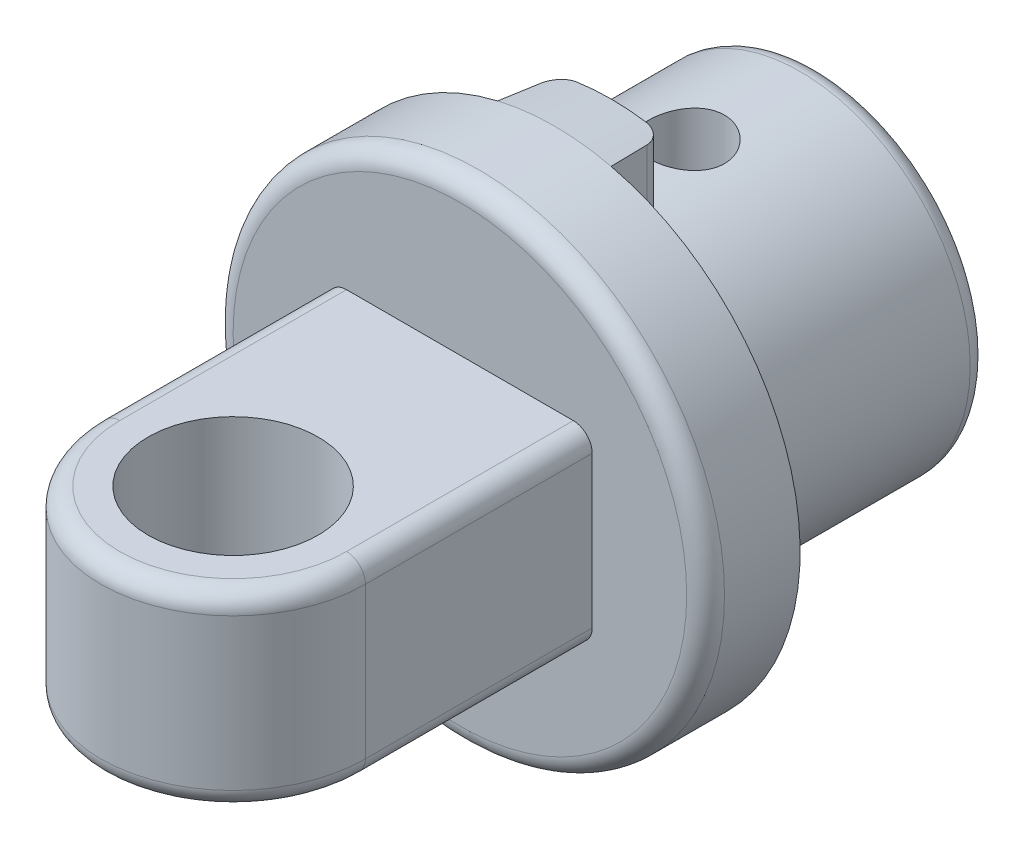
ISO-10303-21;
HEADER;
FILE_DESCRIPTION(('STEP AP214'),'2;1');
FILE_NAME('part.step','',(''),(''),'','','');
FILE_SCHEMA(('AUTOMOTIVE_DESIGN { 1 0 10303 214 1 1 1 1 }'));
ENDSEC;
DATA;
#1=APPLICATION_CONTEXT('core data for automotive mechanical design processes');
#2=APPLICATION_PROTOCOL_DEFINITION('international standard','automotive_design',2000,#1);
#3=PRODUCT_CONTEXT('',#1,'mechanical');
#4=PRODUCT('Part','Part','',(#3));
#5=PRODUCT_RELATED_PRODUCT_CATEGORY('part','',(#4));
#6=PRODUCT_DEFINITION_FORMATION('','',#4);
#7=PRODUCT_DEFINITION_CONTEXT('part definition',#1,'design');
#8=PRODUCT_DEFINITION('design','',#6,#7);
#9=PRODUCT_DEFINITION_SHAPE('','',#8);
#10=(LENGTH_UNIT() NAMED_UNIT(*) SI_UNIT(.MILLI.,.METRE.));
#11=(NAMED_UNIT(*) PLANE_ANGLE_UNIT() SI_UNIT($,.RADIAN.));
#12=(NAMED_UNIT(*) SI_UNIT($,.STERADIAN.) SOLID_ANGLE_UNIT());
#13=UNCERTAINTY_MEASURE_WITH_UNIT(LENGTH_MEASURE(1.E-05),#10,'distance_accuracy_value','');
#14=(GEOMETRIC_REPRESENTATION_CONTEXT(3) GLOBAL_UNCERTAINTY_ASSIGNED_CONTEXT((#13)) GLOBAL_UNIT_ASSIGNED_CONTEXT((#10,
#11,#12)) REPRESENTATION_CONTEXT('',''));
#15=CARTESIAN_POINT('',(0.,0.,0.));
#16=DIRECTION('',(0.,0.,1.));
#17=DIRECTION('',(1.,0.,0.));
#18=AXIS2_PLACEMENT_3D('',#15,#16,#17);
#19=CARTESIAN_POINT('',(0.,0.,7.));
#20=DIRECTION('',(0.,0.,-1.));
#21=DIRECTION('',(-1.,0.,0.));
#22=AXIS2_PLACEMENT_3D('',#19,#20,#21);
#23=CYLINDRICAL_SURFACE('',#22,4.5);
#24=CARTESIAN_POINT('',(0.,0.,0.5));
#25=DIRECTION('',(0.,0.,1.));
#26=DIRECTION('',(1.,0.,0.));
#27=AXIS2_PLACEMENT_3D('',#24,#25,#26);
#28=CIRCLE('',#27,4.5);
#29=CARTESIAN_POINT('',(4.5,0.,0.5));
#30=VERTEX_POINT('',#29);
#31=EDGE_CURVE('E241',#30,#30,#28,.T.);
#32=ORIENTED_EDGE('',*,*,#31,.T.);
#33=EDGE_LOOP('',(#32));
#34=FACE_BOUND('',#33,.T.);
#35=CARTESIAN_POINT('',(0.,4.5,4.5));
#36=CARTESIAN_POINT('',(-0.0554402383878256,4.49999898109126,4.49999813816009));
#37=CARTESIAN_POINT('',(-0.110902782634812,4.49896506997846,4.49537400916826));
#38=CARTESIAN_POINT('',(-0.220250972051568,4.49494048878835,4.47701976382472));
#39=CARTESIAN_POINT('',(-0.274135487569495,4.49194845108674,4.46328328299536));
#40=CARTESIAN_POINT('',(-0.378731638880766,4.48434056584504,4.42715701475417));
#41=CARTESIAN_POINT('',(-0.429446576050144,4.47972644219541,4.40477641150106));
#42=CARTESIAN_POINT('',(-0.526400090156883,4.46937167720689,4.3520266937638));
#43=CARTESIAN_POINT('',(-0.572638753966675,4.46363105773679,4.32165773435469));
#44=CARTESIAN_POINT('',(-0.660093157007019,4.45154547087105,4.25326216744666));
#45=CARTESIAN_POINT('',(-0.701224306021769,4.44519280820714,4.21512874893243));
#46=CARTESIAN_POINT('',(-0.776562455229187,4.43265300539894,4.13251596995343));
#47=CARTESIAN_POINT('',(-0.810768822054278,4.42646588044025,4.08803602964477));
#48=CARTESIAN_POINT('',(-0.871662217051754,4.41488164130856,3.99336407797085));
#49=CARTESIAN_POINT('',(-0.898258710522019,4.40949437871491,3.94311252097923));
#50=CARTESIAN_POINT('',(-0.942596494772542,4.40023048176198,3.83871361915379));
#51=CARTESIAN_POINT('',(-0.960338881100481,4.39635366052386,3.78456675724787));
#52=CARTESIAN_POINT('',(-0.986184290032023,4.39062804729594,3.67483326133867));
#53=CARTESIAN_POINT('',(-0.994437335190345,4.38874772903892,3.61928364244729));
#54=CARTESIAN_POINT('',(-1.00153635498837,4.38713336865335,3.5075588911069));
#55=CARTESIAN_POINT('',(-1.00038352455832,4.38739905389469,3.45138383901893));
#56=CARTESIAN_POINT('',(-0.98882413758651,4.39001816074073,3.3411216864031));
#57=CARTESIAN_POINT('',(-0.978592322301087,4.3923321569242,3.28701518793033));
#58=CARTESIAN_POINT('',(-0.949442453405731,4.39872477095838,3.1813064283375));
#59=CARTESIAN_POINT('',(-0.930523898408259,4.40280349066588,3.1297043119573));
#60=CARTESIAN_POINT('',(-0.884378364364374,4.41230454985148,3.02998028080906));
#61=CARTESIAN_POINT('',(-0.857084596896765,4.41773762181245,2.98189033633196));
#62=CARTESIAN_POINT('',(-0.795010340699249,4.42932868955372,2.89090856474205));
#63=CARTESIAN_POINT('',(-0.760228800371372,4.43548678710298,2.84801746908993));
#64=CARTESIAN_POINT('',(-0.683243418514915,4.44800287306333,2.76764534532576));
#65=CARTESIAN_POINT('',(-0.640891102633118,4.45436225343936,2.73030660744747));
#66=CARTESIAN_POINT('',(-0.550453309045811,4.46643919561159,2.66323813554644));
#67=CARTESIAN_POINT('',(-0.502367720918687,4.47215674504213,2.63350854810905));
#68=CARTESIAN_POINT('',(-0.401651595367368,4.48232532116804,2.58246536211159));
#69=CARTESIAN_POINT('',(-0.349011061159928,4.4867734650383,2.56117087784587));
#70=CARTESIAN_POINT('',(-0.240777965490729,4.49388068183127,2.52776949347106));
#71=CARTESIAN_POINT('',(-0.185185848796684,4.49654002348393,2.51566121329294));
#72=CARTESIAN_POINT('',(-0.0738477416404235,4.49973158880836,2.50118399337241));
#73=CARTESIAN_POINT('',(-0.0181281986594537,4.50030624311145,2.49862074991916));
#74=CARTESIAN_POINT('',(0.0929429619640387,4.49938279325299,2.50277905213018));
#75=CARTESIAN_POINT('',(0.148294605135322,4.4978848344523,2.50949994665972));
#76=CARTESIAN_POINT('',(0.256411628664709,4.49301129379307,2.53187470758405));
#77=CARTESIAN_POINT('',(0.30919924585774,4.4896572350388,2.54742622811172));
#78=CARTESIAN_POINT('',(0.411416402927914,4.48144710543397,2.58690684372254));
#79=CARTESIAN_POINT('',(0.460845650005088,4.4765909038233,2.610836668153));
#80=CARTESIAN_POINT('',(0.555743219947188,4.4658107661382,2.66679643839949));
#81=CARTESIAN_POINT('',(0.601142865416122,4.45987222295124,2.69893997150308));
#82=CARTESIAN_POINT('',(0.685973482494058,4.4476151617454,2.77026562455072));
#83=CARTESIAN_POINT('',(0.725403650867062,4.44129659275088,2.80944869016605));
#84=CARTESIAN_POINT('',(0.797947740954926,4.42884439472905,2.89463401679035));
#85=CARTESIAN_POINT('',(0.830926909700365,4.42271658832142,2.9407520450033));
#86=CARTESIAN_POINT('',(0.888673059613759,4.41147697689154,3.03798601720541));
#87=CARTESIAN_POINT('',(0.913440399634866,4.40636512747635,3.08910174267105));
#88=CARTESIAN_POINT('',(0.953890009481294,4.39778600274463,3.19460414455257));
#89=CARTESIAN_POINT('',(0.969623931773793,4.39430939829893,3.24897022113442));
#90=CARTESIAN_POINT('',(0.991710138292028,4.38937824848696,3.35966209243124));
#91=CARTESIAN_POINT('',(0.99806397859178,4.38792336773666,3.41598756051298));
#92=CARTESIAN_POINT('',(1.00114178320522,4.38722200724489,3.52763943913916));
#93=CARTESIAN_POINT('',(0.998079565719666,4.38792649185062,3.58295975403003));
#94=CARTESIAN_POINT('',(0.982891385608438,4.39135332478774,3.69227485498341));
#95=CARTESIAN_POINT('',(0.970765537001196,4.39407564773517,3.74626965771174));
#96=CARTESIAN_POINT('',(0.93789909990372,4.40120714065763,3.85122456011369));
#97=CARTESIAN_POINT('',(0.917190583142266,4.40561002591385,3.9021951584408));
#98=CARTESIAN_POINT('',(0.867773851741709,4.41560882234529,3.99996999627336));
#99=CARTESIAN_POINT('',(0.839064772925966,4.42120486238316,4.046773784982));
#100=CARTESIAN_POINT('',(0.773756794952788,4.43310521417665,4.13593830447399));
#101=CARTESIAN_POINT('',(0.73700592755519,4.4394218568387,4.17818610246133));
#102=CARTESIAN_POINT('',(0.656964352972518,4.45196987086694,4.25598503696566));
#103=CARTESIAN_POINT('',(0.613672133116716,4.45820122214526,4.29153462025421));
#104=CARTESIAN_POINT('',(0.521072985322781,4.46997629863291,4.35538799145996));
#105=CARTESIAN_POINT('',(0.471692818317473,4.47550961749614,4.38358759986747));
#106=CARTESIAN_POINT('',(0.368780139889407,4.48516029184625,4.4312416520906));
#107=CARTESIAN_POINT('',(0.315251101656495,4.48927881635408,4.45070332002308));
#108=CARTESIAN_POINT('',(0.218069123864702,4.49491406454777,4.47692067513839));
#109=CARTESIAN_POINT('',(0.174935995950839,4.49680934511605,4.48555868683314));
#110=CARTESIAN_POINT('',(0.0878732249472619,4.49935268729894,4.49709895215308));
#111=CARTESIAN_POINT('',(0.0439436194464373,4.50000080761806,4.50000147575095));
#112=CARTESIAN_POINT('',(0.,4.5,4.5));
#113=B_SPLINE_CURVE_WITH_KNOTS('',3,(#35,#36,#37,#38,#39,#40,#41,#42,#43,#44,#45,#46,#47,#48,
#49,#50,#51,#52,#53,#54,#55,#56,#57,#58,#59,#60,#61,#62,#63,#64,#65,#66,#67,#68,#69,#70,#71,#72,
#73,#74,#75,#76,#77,#78,#79,#80,#81,#82,#83,#84,#85,#86,#87,#88,#89,#90,#91,#92,#93,#94,#95,#96,
#97,#98,#99,#100,#101,#102,#103,#104,#105,#106,#107,#108,#109,#110,#111,#112),.UNSPECIFIED.,.T.,
.F.,(4,2,2,2,2,2,2,2,2,2,2,2,2,2,2,2,2,2,2,2,2,2,2,2,2,2,2,2,2,2,2,2,2,2,2,2,2,2,4),(0.,
0.166159844864898,0.332435865624642,0.49853570620373,0.664632322584946,0.833190360010395,
1.00176380745257,1.17226648148988,1.3427480534387,1.51049562819054,1.67822189248295,
1.84278834072892,2.0073642887347,2.17328834854791,2.3392357262915,2.50889089904488,
2.67854933984914,2.84859006405619,3.01860523750994,3.18513996062134,3.35166300456134,
3.51629434712583,3.6809400247273,3.84799901631021,4.01508046693878,4.18534736552864,
4.35560682255206,4.52488279527622,4.69413068343205,4.85956392571208,5.02499508691429,
5.1898135600789,5.35464984293193,5.52292163156413,5.69123239233205,5.86181293524784,
6.03225218935468,6.16396173679279,6.29566508443975),.UNSPECIFIED.);
#114=CARTESIAN_POINT('',(0.,4.5,4.5));
#115=VERTEX_POINT('',#114);
#116=EDGE_CURVE('E175',#115,#115,#113,.T.);
#117=ORIENTED_EDGE('',*,*,#116,.T.);
#118=EDGE_LOOP('',(#117));
#119=FACE_BOUND('',#118,.T.);
#120=CARTESIAN_POINT('',(0.,-4.5,4.5));
#121=CARTESIAN_POINT('',(0.0554402383878227,-4.49999898109126,4.49999813816009));
#122=CARTESIAN_POINT('',(0.110902782634809,-4.49896506997846,4.49537400916826));
#123=CARTESIAN_POINT('',(0.220250972051565,-4.49494048878835,4.47701976382472));
#124=CARTESIAN_POINT('',(0.274135487569492,-4.49194845108674,4.46328328299536));
#125=CARTESIAN_POINT('',(0.378731638880763,-4.48434056584504,4.42715701475417));
#126=CARTESIAN_POINT('',(0.429446576050141,-4.47972644219541,4.40477641150107));
#127=CARTESIAN_POINT('',(0.52640009015688,-4.46937167720689,4.3520266937638));
#128=CARTESIAN_POINT('',(0.572638753966672,-4.46363105773679,4.32165773435469));
#129=CARTESIAN_POINT('',(0.660093157007016,-4.45154547087105,4.25326216744666));
#130=CARTESIAN_POINT('',(0.701224306021766,-4.44519280820714,4.21512874893243));
#131=CARTESIAN_POINT('',(0.776562455229184,-4.43265300539894,4.13251596995343));
#132=CARTESIAN_POINT('',(0.810768822054275,-4.42646588044025,4.08803602964477));
#133=CARTESIAN_POINT('',(0.871662217051751,-4.41488164130856,3.99336407797085));
#134=CARTESIAN_POINT('',(0.898258710522016,-4.40949437871491,3.94311252097923));
#135=CARTESIAN_POINT('',(0.942596494772539,-4.40023048176198,3.83871361915379));
#136=CARTESIAN_POINT('',(0.960338881100478,-4.39635366052386,3.78456675724787));
#137=CARTESIAN_POINT('',(0.98618429003202,-4.39062804729595,3.67483326133867));
#138=CARTESIAN_POINT('',(0.994437335190342,-4.38874772903892,3.61928364244729));
#139=CARTESIAN_POINT('',(1.00153635498836,-4.38713336865335,3.5075588911069));
#140=CARTESIAN_POINT('',(1.00038352455831,-4.3873990538947,3.45138383901893));
#141=CARTESIAN_POINT('',(0.988824137586507,-4.39001816074073,3.3411216864031));
#142=CARTESIAN_POINT('',(0.978592322301083,-4.3923321569242,3.28701518793033));
#143=CARTESIAN_POINT('',(0.949442453405728,-4.39872477095838,3.1813064283375));
#144=CARTESIAN_POINT('',(0.930523898408256,-4.40280349066588,3.1297043119573));
#145=CARTESIAN_POINT('',(0.884378364364371,-4.41230454985148,3.02998028080906));
#146=CARTESIAN_POINT('',(0.857084596896762,-4.41773762181245,2.98189033633196));
#147=CARTESIAN_POINT('',(0.795010340699246,-4.42932868955372,2.89090856474205));
#148=CARTESIAN_POINT('',(0.760228800371369,-4.43548678710299,2.84801746908993));
#149=CARTESIAN_POINT('',(0.683243418514912,-4.44800287306333,2.76764534532576));
#150=CARTESIAN_POINT('',(0.640891102633114,-4.45436225343936,2.73030660744747));
#151=CARTESIAN_POINT('',(0.550453309045808,-4.46643919561159,2.66323813554644));
#152=CARTESIAN_POINT('',(0.502367720918683,-4.47215674504213,2.63350854810905));
#153=CARTESIAN_POINT('',(0.401651595367365,-4.48232532116804,2.58246536211159));
#154=CARTESIAN_POINT('',(0.349011061159925,-4.4867734650383,2.56117087784587));
#155=CARTESIAN_POINT('',(0.240777965490726,-4.49388068183128,2.52776949347106));
#156=CARTESIAN_POINT('',(0.185185848796681,-4.49654002348393,2.51566121329294));
#157=CARTESIAN_POINT('',(0.0738477416404201,-4.49973158880836,2.50118399337241));
#158=CARTESIAN_POINT('',(0.0181281986594502,-4.50030624311145,2.49862074991916));
#159=CARTESIAN_POINT('',(-0.0929429619640422,-4.49938279325299,2.50277905213018));
#160=CARTESIAN_POINT('',(-0.148294605135325,-4.4978848344523,2.50949994665972));
#161=CARTESIAN_POINT('',(-0.256411628664713,-4.49301129379307,2.53187470758405));
#162=CARTESIAN_POINT('',(-0.309199245857744,-4.4896572350388,2.54742622811172));
#163=CARTESIAN_POINT('',(-0.411416402927918,-4.48144710543398,2.58690684372254));
#164=CARTESIAN_POINT('',(-0.460845650005091,-4.4765909038233,2.610836668153));
#165=CARTESIAN_POINT('',(-0.555743219947191,-4.4658107661382,2.66679643839949));
#166=CARTESIAN_POINT('',(-0.601142865416125,-4.45987222295124,2.69893997150308));
#167=CARTESIAN_POINT('',(-0.685973482494062,-4.4476151617454,2.77026562455072));
#168=CARTESIAN_POINT('',(-0.725403650867065,-4.44129659275087,2.80944869016605));
#169=CARTESIAN_POINT('',(-0.797947740954929,-4.42884439472905,2.89463401679035));
#170=CARTESIAN_POINT('',(-0.830926909700368,-4.42271658832142,2.9407520450033));
#171=CARTESIAN_POINT('',(-0.888673059613762,-4.41147697689154,3.03798601720541));
#172=CARTESIAN_POINT('',(-0.91344039963487,-4.40636512747635,3.08910174267105));
#173=CARTESIAN_POINT('',(-0.953890009481297,-4.39778600274463,3.19460414455257));
#174=CARTESIAN_POINT('',(-0.969623931773797,-4.39430939829893,3.24897022113442));
#175=CARTESIAN_POINT('',(-0.991710138292031,-4.38937824848696,3.35966209243124));
#176=CARTESIAN_POINT('',(-0.998063978591783,-4.38792336773666,3.41598756051298));
#177=CARTESIAN_POINT('',(-1.00114178320522,-4.38722200724489,3.52763943913916));
#178=CARTESIAN_POINT('',(-0.998079565719669,-4.38792649185062,3.58295975403003));
#179=CARTESIAN_POINT('',(-0.98289138560844,-4.39135332478774,3.69227485498341));
#180=CARTESIAN_POINT('',(-0.970765537001199,-4.39407564773517,3.74626965771174));
#181=CARTESIAN_POINT('',(-0.937899099903723,-4.40120714065762,3.85122456011369));
#182=CARTESIAN_POINT('',(-0.917190583142269,-4.40561002591385,3.9021951584408));
#183=CARTESIAN_POINT('',(-0.867773851741712,-4.41560882234529,3.99996999627336));
#184=CARTESIAN_POINT('',(-0.839064772925969,-4.42120486238316,4.046773784982));
#185=CARTESIAN_POINT('',(-0.773756794952791,-4.43310521417665,4.13593830447399));
#186=CARTESIAN_POINT('',(-0.737005927555193,-4.4394218568387,4.17818610246133));
#187=CARTESIAN_POINT('',(-0.656964352972521,-4.45196987086694,4.25598503696566));
#188=CARTESIAN_POINT('',(-0.613672133116718,-4.45820122214526,4.29153462025421));
#189=CARTESIAN_POINT('',(-0.521072985322784,-4.46997629863291,4.35538799145996));
#190=CARTESIAN_POINT('',(-0.471692818317475,-4.47550961749614,4.38358759986747));
#191=CARTESIAN_POINT('',(-0.36878013988941,-4.48516029184625,4.4312416520906));
#192=CARTESIAN_POINT('',(-0.315251101656498,-4.48927881635408,4.45070332002308));
#193=CARTESIAN_POINT('',(-0.218069123864706,-4.49491406454777,4.47692067513839));
#194=CARTESIAN_POINT('',(-0.174935995950842,-4.49680934511605,4.48555868683314));
#195=CARTESIAN_POINT('',(-0.0878732249472655,-4.49935268729894,4.49709895215308));
#196=CARTESIAN_POINT('',(-0.0439436194464406,-4.50000080761806,4.50000147575095));
#197=CARTESIAN_POINT('',(0.,-4.5,4.5));
#198=B_SPLINE_CURVE_WITH_KNOTS('',3,(#120,#121,#122,#123,#124,#125,#126,#127,#128,#129,#130,
#131,#132,#133,#134,#135,#136,#137,#138,#139,#140,#141,#142,#143,#144,#145,#146,#147,#148,#149,
#150,#151,#152,#153,#154,#155,#156,#157,#158,#159,#160,#161,#162,#163,#164,#165,#166,#167,#168,
#169,#170,#171,#172,#173,#174,#175,#176,#177,#178,#179,#180,#181,#182,#183,#184,#185,#186,#187,
#188,#189,#190,#191,#192,#193,#194,#195,#196,#197),.UNSPECIFIED.,.T.,.F.,(4,2,2,2,2,2,2,2,2,2,2,
2,2,2,2,2,2,2,2,2,2,2,2,2,2,2,2,2,2,2,2,2,2,2,2,2,2,2,4),(0.,0.166159844864898,
0.332435865624642,0.49853570620373,0.664632322584946,0.833190360010395,1.00176380745257,
1.17226648148988,1.3427480534387,1.51049562819053,1.67822189248295,1.84278834072892,
2.0073642887347,2.17328834854791,2.3392357262915,2.50889089904488,2.67854933984914,
2.84859006405619,3.01860523750994,3.18513996062134,3.35166300456134,3.51629434712583,
3.6809400247273,3.84799901631021,4.01508046693878,4.18534736552864,4.35560682255206,
4.52488279527622,4.69413068343206,4.85956392571208,5.0249950869143,5.1898135600789,
5.35464984293193,5.52292163156413,5.69123239233205,5.86181293524784,6.03225218935468,
6.16396173679279,6.29566508443975),.UNSPECIFIED.);
#199=CARTESIAN_POINT('',(0.,-4.5,4.5));
#200=VERTEX_POINT('',#199);
#201=EDGE_CURVE('E174',#200,#200,#198,.T.);
#202=ORIENTED_EDGE('',*,*,#201,.T.);
#203=EDGE_LOOP('',(#202));
#204=FACE_BOUND('',#203,.T.);
#205=CARTESIAN_POINT('',(0.,0.,-10.145078454142));
#206=DIRECTION('',(0.996194698091746,0.,-0.0871557427476584));
#207=DIRECTION('',(-0.0871557427476584,0.,-0.996194698091746));
#208=AXIS2_PLACEMENT_3D('',#205,#206,#207);
#209=ELLIPSE('',#208,51.6317096055142,4.5);
#210=CARTESIAN_POINT('',(1.5,4.24264068711928,7.));
#211=VERTEX_POINT('',#210);
#212=CARTESIAN_POINT('',(1.40869876674828,4.27382355561877,5.95642212862617));
#213=VERTEX_POINT('',#212);
#214=EDGE_CURVE('E181',#211,#213,#209,.F.);
#215=ORIENTED_EDGE('',*,*,#214,.F.);
#216=CARTESIAN_POINT('',(0.,0.,7.));
#217=DIRECTION('',(0.,0.,1.));
#218=DIRECTION('',(1.,0.,0.));
#219=AXIS2_PLACEMENT_3D('',#216,#217,#218);
#220=CIRCLE('',#219,4.5);
#221=CARTESIAN_POINT('',(-1.5,4.24264068711928,7.));
#222=VERTEX_POINT('',#221);
#223=EDGE_CURVE('E149',#222,#211,#220,.T.);
#224=ORIENTED_EDGE('',*,*,#223,.F.);
#225=CARTESIAN_POINT('',(0.,0.,-10.145078454142));
#226=DIRECTION('',(-0.996194698091746,0.,-0.0871557427476584));
#227=DIRECTION('',(0.0871557427476584,0.,-0.996194698091746));
#228=AXIS2_PLACEMENT_3D('',#225,#226,#227);
#229=ELLIPSE('',#228,51.6317096055142,4.5);
#230=CARTESIAN_POINT('',(-1.40869876674828,4.27382355561877,5.95642212862617));
#231=VERTEX_POINT('',#230);
#232=EDGE_CURVE('E140',#231,#222,#229,.F.);
#233=ORIENTED_EDGE('',*,*,#232,.F.);
#234=CARTESIAN_POINT('',(-1.40869876674828,4.27382355561877,5.95642212862617));
#235=CARTESIAN_POINT('',(-1.40633257261561,4.27459681588559,5.92907045406466));
#236=CARTESIAN_POINT('',(-1.40166666203264,4.27613930027423,5.90196515826839));
#237=CARTESIAN_POINT('',(-1.38804172947475,4.2805847817457,5.84904281327923));
#238=CARTESIAN_POINT('',(-1.3790936444537,4.28348431243041,5.82322266618661));
#239=CARTESIAN_POINT('',(-1.3571999274779,4.29047028810966,5.77352934278165));
#240=CARTESIAN_POINT('',(-1.34425583936322,4.29455627468548,5.74965541904857));
#241=CARTESIAN_POINT('',(-1.31478599458177,4.30367008545042,5.7044271765172));
#242=CARTESIAN_POINT('',(-1.29825893919812,4.30869825106096,5.68307377567795));
#243=CARTESIAN_POINT('',(-1.26155532066334,4.31958959784951,5.64279432769641));
#244=CARTESIAN_POINT('',(-1.24128463783114,4.32547320552356,5.62395963536281));
#245=CARTESIAN_POINT('',(-1.19799461547281,4.33766229639475,5.5899223443352));
#246=CARTESIAN_POINT('',(-1.17497399732994,4.34396797523535,5.57472144515424));
#247=CARTESIAN_POINT('',(-1.12582944668014,4.35696901168054,5.54779097286443));
#248=CARTESIAN_POINT('',(-1.0996188297867,4.3636699213527,5.53622231215272));
#249=CARTESIAN_POINT('',(-1.04559322333529,4.37692875690206,5.51772376201776));
#250=CARTESIAN_POINT('',(-1.01778010252842,4.38348683750982,5.5107885836243));
#251=CARTESIAN_POINT('',(-0.976520946372943,4.39278808826037,5.50418777801486));
#252=CARTESIAN_POINT('',(-0.963390515451278,4.39568657565852,5.50261841383901));
#253=CARTESIAN_POINT('',(-0.93704673041951,4.40137760931593,5.5005255737308));
#254=CARTESIAN_POINT('',(-0.923833549716373,4.40417032312462,5.50000036946821));
#255=CARTESIAN_POINT('',(-0.91060141770241,4.40690424879851,5.49999999999996));
#256=B_SPLINE_CURVE_WITH_KNOTS('',3,(#234,#235,#236,#237,#238,#239,#240,#241,#242,#243,#244,
#245,#246,#247,#248,#249,#250,#251,#252,#253,#254,#255),.UNSPECIFIED.,.F.,.F.,(4,2,2,2,2,2,2,2,
2,2,4),(0.,0.0822540536191196,0.164299137196094,0.246312562563392,0.328355765159798,
0.412845118861046,0.497373910979838,0.585242998118194,0.67301161338808,0.713590314428364,
0.754101792067005),.UNSPECIFIED.);
#257=CARTESIAN_POINT('',(-0.910601417702403,4.40690424879851,5.5));
#258=VERTEX_POINT('',#257);
#259=EDGE_CURVE('E11',#231,#258,#256,.T.);
#260=ORIENTED_EDGE('',*,*,#259,.T.);
#261=CARTESIAN_POINT('',(0.,0.,5.5));
#262=DIRECTION('',(0.,0.,-1.));
#263=DIRECTION('',(-1.,0.,0.));
#264=AXIS2_PLACEMENT_3D('',#261,#262,#263);
#265=CIRCLE('',#264,4.5);
#266=CARTESIAN_POINT('',(0.910601417702403,4.40690424879851,5.5));
#267=VERTEX_POINT('',#266);
#268=EDGE_CURVE('E169',#258,#267,#265,.T.);
#269=ORIENTED_EDGE('',*,*,#268,.T.);
#270=CARTESIAN_POINT('',(0.910601417702403,4.40690424879851,5.5));
#271=CARTESIAN_POINT('',(0.939500369762646,4.40094403505298,5.49998047651591));
#272=CARTESIAN_POINT('',(0.968321184535207,4.39468154347176,5.50250381778121));
#273=CARTESIAN_POINT('',(1.02500847589894,4.38180049133814,5.51242138022054));
#274=CARTESIAN_POINT('',(1.05287566675026,4.37518220726854,5.5198118680279));
#275=CARTESIAN_POINT('',(1.10690709807278,4.36182748772447,5.53925049762021));
#276=CARTESIAN_POINT('',(1.13307116227188,4.35509104011149,5.5512991206253));
#277=CARTESIAN_POINT('',(1.18298223981093,4.34179901561257,5.57972279173503));
#278=CARTESIAN_POINT('',(1.20672945441032,4.33524342369935,5.59609747918428));
#279=CARTESIAN_POINT('',(1.25121603346764,4.32261450963266,5.63282612706337));
#280=CARTESIAN_POINT('',(1.2719447606372,4.31654292560484,5.65319359372168));
#281=CARTESIAN_POINT('',(1.3096653148912,4.30524861786887,5.69735985043142));
#282=CARTESIAN_POINT('',(1.32665602476102,4.30002614806445,5.72115966282959));
#283=CARTESIAN_POINT('',(1.35592199025858,4.29088622188522,5.77087050970922));
#284=CARTESIAN_POINT('',(1.36830874117071,4.2869382632913,5.79671023197877));
#285=CARTESIAN_POINT('',(1.38849964574047,4.28044217184378,5.85024265120152));
#286=CARTESIAN_POINT('',(1.39631327778895,4.27789114437856,5.87793138209712));
#287=CARTESIAN_POINT('',(1.4048905655234,4.27507744038331,5.92274223287516));
#288=CARTESIAN_POINT('',(1.40723116704355,4.27430538998321,5.93954356246408));
#289=CARTESIAN_POINT('',(1.40869876674828,4.27382355561878,5.95642212862617));
#290=B_SPLINE_CURVE_WITH_KNOTS('',3,(#270,#271,#272,#273,#274,#275,#276,#277,#278,#279,#280,
#281,#282,#283,#284,#285,#286,#287,#288,#289),.UNSPECIFIED.,.F.,.F.,(4,2,2,2,2,2,2,2,2,4),(0.,
0.0883906547008107,0.176713587797798,0.265045647752213,0.353370345960759,0.441999139279864,
0.530654386000081,0.616995819466224,0.703157659347407,0.754002906714525),.UNSPECIFIED.);
#291=EDGE_CURVE('E43',#267,#213,#290,.T.);
#292=ORIENTED_EDGE('',*,*,#291,.T.);
#293=EDGE_LOOP('',(#215,#224,#233,#260,#269,#292));
#294=FACE_BOUND('',#293,.T.);
#295=ADVANCED_FACE('F31',(#34,#119,#204,#294),#23,.T.);
#296=CARTESIAN_POINT('',(0.,0.,7.));
#297=DIRECTION('',(0.,0.,1.));
#298=DIRECTION('',(1.,0.,0.));
#299=AXIS2_PLACEMENT_3D('',#296,#297,#298);
#300=PLANE('',#299);
#301=DIRECTION('',(0.,-1.,0.));
#302=VECTOR('',#301,1.);
#303=CARTESIAN_POINT('',(1.5,6.32455532033676,7.));
#304=LINE('',#303,#302);
#305=CARTESIAN_POINT('',(1.5,6.32455532033676,7.));
#306=VERTEX_POINT('',#305);
#307=EDGE_CURVE('E137',#306,#211,#304,.T.);
#308=ORIENTED_EDGE('',*,*,#307,.F.);
#309=CARTESIAN_POINT('',(0.,0.,7.));
#310=DIRECTION('',(0.,0.,1.));
#311=DIRECTION('',(1.,0.,0.));
#312=AXIS2_PLACEMENT_3D('',#309,#310,#311);
#313=CIRCLE('',#312,6.5);
#314=CARTESIAN_POINT('',(-1.5,6.32455532033676,7.));
#315=VERTEX_POINT('',#314);
#316=EDGE_CURVE('E150',#315,#306,#313,.T.);
#317=ORIENTED_EDGE('',*,*,#316,.F.);
#318=DIRECTION('',(0.,1.,0.));
#319=VECTOR('',#318,1.);
#320=CARTESIAN_POINT('',(-1.5,6.32455532033676,7.));
#321=LINE('',#320,#319);
#322=EDGE_CURVE('E158',#222,#315,#321,.T.);
#323=ORIENTED_EDGE('',*,*,#322,.F.);
#324=ORIENTED_EDGE('',*,*,#223,.T.);
#325=EDGE_LOOP('',(#308,#317,#323,#324));
#326=FACE_BOUND('',#325,.T.);
#327=ADVANCED_FACE('F155',(#326),#300,.F.);
#328=CARTESIAN_POINT('',(0.,0.,0.));
#329=DIRECTION('',(0.,0.,1.));
#330=DIRECTION('',(1.,0.,0.));
#331=AXIS2_PLACEMENT_3D('',#328,#329,#330);
#332=PLANE('',#331);
#333=CARTESIAN_POINT('',(0.,0.,0.));
#334=DIRECTION('',(0.,0.,1.));
#335=DIRECTION('',(1.,0.,0.));
#336=AXIS2_PLACEMENT_3D('',#333,#334,#335);
#337=CIRCLE('',#336,4.);
#338=CARTESIAN_POINT('',(4.,0.,0.));
#339=VERTEX_POINT('',#338);
#340=EDGE_CURVE('E294',#339,#339,#337,.F.);
#341=ORIENTED_EDGE('',*,*,#340,.T.);
#342=EDGE_LOOP('',(#341));
#343=FACE_BOUND('',#342,.T.);
#344=ADVANCED_FACE('F223',(#343),#332,.F.);
#345=CARTESIAN_POINT('',(0.,0.,9.5));
#346=DIRECTION('',(0.,0.,-1.));
#347=DIRECTION('',(-1.,0.,0.));
#348=AXIS2_PLACEMENT_3D('',#345,#346,#347);
#349=CYLINDRICAL_SURFACE('',#348,6.5);
#350=CARTESIAN_POINT('',(0.,0.,9.));
#351=DIRECTION('',(0.,0.,1.));
#352=DIRECTION('',(1.,0.,0.));
#353=AXIS2_PLACEMENT_3D('',#350,#351,#352);
#354=CIRCLE('',#353,6.5);
#355=CARTESIAN_POINT('',(6.5,0.,9.));
#356=VERTEX_POINT('',#355);
#357=EDGE_CURVE('E426',#356,#356,#354,.F.);
#358=ORIENTED_EDGE('',*,*,#357,.T.);
#359=EDGE_LOOP('',(#358));
#360=FACE_BOUND('',#359,.T.);
#361=EDGE_CURVE('E144',#306,#315,#313,.T.);
#362=ORIENTED_EDGE('',*,*,#361,.T.);
#363=ORIENTED_EDGE('',*,*,#316,.T.);
#364=EDGE_LOOP('',(#362,#363));
#365=FACE_BOUND('',#364,.T.);
#366=ADVANCED_FACE('F161',(#360,#365),#349,.T.);
#367=CARTESIAN_POINT('',(0.,0.,9.5));
#368=DIRECTION('',(0.,0.,1.));
#369=DIRECTION('',(1.,0.,0.));
#370=AXIS2_PLACEMENT_3D('',#367,#368,#369);
#371=PLANE('',#370);
#372=CARTESIAN_POINT('',(0.,0.,9.5));
#373=DIRECTION('',(0.,0.,1.));
#374=DIRECTION('',(1.,0.,0.));
#375=AXIS2_PLACEMENT_3D('',#372,#373,#374);
#376=CIRCLE('',#375,6.);
#377=CARTESIAN_POINT('',(6.,0.,9.5));
#378=VERTEX_POINT('',#377);
#379=EDGE_CURVE('E424',#378,#378,#376,.T.);
#380=ORIENTED_EDGE('',*,*,#379,.T.);
#381=EDGE_LOOP('',(#380));
#382=FACE_BOUND('',#381,.T.);
#383=DIRECTION('',(-1.,0.,0.));
#384=VECTOR('',#383,1.);
#385=CARTESIAN_POINT('',(-3.5,2.5,9.5));
#386=LINE('',#385,#384);
#387=CARTESIAN_POINT('',(3.,2.5,9.5));
#388=VERTEX_POINT('',#387);
#389=CARTESIAN_POINT('',(-3.,2.5,9.5));
#390=VERTEX_POINT('',#389);
#391=EDGE_CURVE('E258',#388,#390,#386,.T.);
#392=ORIENTED_EDGE('',*,*,#391,.F.);
#393=CARTESIAN_POINT('',(3.,2.,9.5));
#394=DIRECTION('',(0.,0.,1.));
#395=DIRECTION('',(1.,0.,0.));
#396=AXIS2_PLACEMENT_3D('',#393,#394,#395);
#397=CIRCLE('',#396,0.5);
#398=CARTESIAN_POINT('',(3.5,2.,9.5));
#399=VERTEX_POINT('',#398);
#400=EDGE_CURVE('E431',#388,#399,#397,.F.);
#401=ORIENTED_EDGE('',*,*,#400,.T.);
#402=DIRECTION('',(0.,-1.,0.));
#403=VECTOR('',#402,1.);
#404=CARTESIAN_POINT('',(3.5,2.5,9.5));
#405=LINE('',#404,#403);
#406=CARTESIAN_POINT('',(3.5,-2.,9.5));
#407=VERTEX_POINT('',#406);
#408=EDGE_CURVE('E261',#399,#407,#405,.T.);
#409=ORIENTED_EDGE('',*,*,#408,.T.);
#410=CARTESIAN_POINT('',(3.,-2.,9.5));
#411=DIRECTION('',(0.,0.,1.));
#412=DIRECTION('',(1.,0.,0.));
#413=AXIS2_PLACEMENT_3D('',#410,#411,#412);
#414=CIRCLE('',#413,0.5);
#415=CARTESIAN_POINT('',(3.,-2.5,9.5));
#416=VERTEX_POINT('',#415);
#417=EDGE_CURVE('E353',#407,#416,#414,.F.);
#418=ORIENTED_EDGE('',*,*,#417,.T.);
#419=DIRECTION('',(-1.,0.,0.));
#420=VECTOR('',#419,1.);
#421=CARTESIAN_POINT('',(-3.5,-2.5,9.5));
#422=LINE('',#421,#420);
#423=CARTESIAN_POINT('',(-3.,-2.5,9.5));
#424=VERTEX_POINT('',#423);
#425=EDGE_CURVE('E255',#416,#424,#422,.T.);
#426=ORIENTED_EDGE('',*,*,#425,.T.);
#427=CARTESIAN_POINT('',(-3.,-2.,9.5));
#428=DIRECTION('',(0.,0.,1.));
#429=DIRECTION('',(1.,0.,0.));
#430=AXIS2_PLACEMENT_3D('',#427,#428,#429);
#431=CIRCLE('',#430,0.5);
#432=CARTESIAN_POINT('',(-3.5,-2.,9.5));
#433=VERTEX_POINT('',#432);
#434=EDGE_CURVE('E374',#424,#433,#431,.F.);
#435=ORIENTED_EDGE('',*,*,#434,.T.);
#436=DIRECTION('',(0.,-1.,0.));
#437=VECTOR('',#436,1.);
#438=CARTESIAN_POINT('',(-3.5,2.5,9.5));
#439=LINE('',#438,#437);
#440=CARTESIAN_POINT('',(-3.5,2.,9.5));
#441=VERTEX_POINT('',#440);
#442=EDGE_CURVE('E162',#441,#433,#439,.T.);
#443=ORIENTED_EDGE('',*,*,#442,.F.);
#444=CARTESIAN_POINT('',(-3.,2.,9.5));
#445=DIRECTION('',(0.,0.,1.));
#446=DIRECTION('',(1.,0.,0.));
#447=AXIS2_PLACEMENT_3D('',#444,#445,#446);
#448=CIRCLE('',#447,0.5);
#449=EDGE_CURVE('E373',#441,#390,#448,.F.);
#450=ORIENTED_EDGE('',*,*,#449,.T.);
#451=EDGE_LOOP('',(#392,#401,#409,#418,#426,#435,#443,#450));
#452=FACE_BOUND('',#451,.T.);
#453=ADVANCED_FACE('F219',(#382,#452),#371,.T.);
#454=CARTESIAN_POINT('',(-3.5,2.5,9.5));
#455=DIRECTION('',(1.,0.,0.));
#456=DIRECTION('',(0.,0.,-1.));
#457=AXIS2_PLACEMENT_3D('',#454,#455,#456);
#458=PLANE('',#457);
#459=ORIENTED_EDGE('',*,*,#442,.T.);
#460=DIRECTION('',(0.,0.,1.));
#461=VECTOR('',#460,1.);
#462=CARTESIAN_POINT('',(-3.5,-2.,9.5));
#463=LINE('',#462,#461);
#464=CARTESIAN_POINT('',(-3.5,-2.,15.5));
#465=VERTEX_POINT('',#464);
#466=EDGE_CURVE('E282',#433,#465,#463,.T.);
#467=ORIENTED_EDGE('',*,*,#466,.T.);
#468=DIRECTION('',(0.,-1.,0.));
#469=VECTOR('',#468,1.);
#470=CARTESIAN_POINT('',(-3.5,2.5,15.5));
#471=LINE('',#470,#469);
#472=CARTESIAN_POINT('',(-3.5,2.,15.5));
#473=VERTEX_POINT('',#472);
#474=EDGE_CURVE('E164',#473,#465,#471,.T.);
#475=ORIENTED_EDGE('',*,*,#474,.F.);
#476=DIRECTION('',(0.,0.,1.));
#477=VECTOR('',#476,1.);
#478=CARTESIAN_POINT('',(-3.5,2.,9.5));
#479=LINE('',#478,#477);
#480=EDGE_CURVE('E368',#473,#441,#479,.F.);
#481=ORIENTED_EDGE('',*,*,#480,.T.);
#482=EDGE_LOOP('',(#459,#467,#475,#481));
#483=FACE_BOUND('',#482,.T.);
#484=ADVANCED_FACE('F215',(#483),#458,.F.);
#485=CARTESIAN_POINT('',(0.,2.5,15.5));
#486=DIRECTION('',(0.,-1.,0.));
#487=DIRECTION('',(0.,0.,-1.));
#488=AXIS2_PLACEMENT_3D('',#485,#486,#487);
#489=CYLINDRICAL_SURFACE('',#488,3.5);
#490=ORIENTED_EDGE('',*,*,#474,.T.);
#491=CARTESIAN_POINT('',(0.,-2.,15.5));
#492=DIRECTION('',(0.,1.,0.));
#493=DIRECTION('',(0.,0.,1.));
#494=AXIS2_PLACEMENT_3D('',#491,#492,#493);
#495=CIRCLE('',#494,3.5);
#496=CARTESIAN_POINT('',(3.5,-2.,15.5));
#497=VERTEX_POINT('',#496);
#498=EDGE_CURVE('E271',#465,#497,#495,.T.);
#499=ORIENTED_EDGE('',*,*,#498,.T.);
#500=DIRECTION('',(0.,-1.,0.));
#501=VECTOR('',#500,1.);
#502=CARTESIAN_POINT('',(3.5,2.5,15.5));
#503=LINE('',#502,#501);
#504=CARTESIAN_POINT('',(3.5,2.,15.5));
#505=VERTEX_POINT('',#504);
#506=EDGE_CURVE('E264',#505,#497,#503,.T.);
#507=ORIENTED_EDGE('',*,*,#506,.F.);
#508=CARTESIAN_POINT('',(0.,2.,15.5));
#509=DIRECTION('',(0.,1.,0.));
#510=DIRECTION('',(0.,0.,1.));
#511=AXIS2_PLACEMENT_3D('',#508,#509,#510);
#512=CIRCLE('',#511,3.5);
#513=EDGE_CURVE('E273',#505,#473,#512,.F.);
#514=ORIENTED_EDGE('',*,*,#513,.T.);
#515=EDGE_LOOP('',(#490,#499,#507,#514));
#516=FACE_BOUND('',#515,.T.);
#517=ADVANCED_FACE('F211',(#516),#489,.T.);
#518=CARTESIAN_POINT('',(3.5,2.5,9.5));
#519=DIRECTION('',(-1.,0.,0.));
#520=DIRECTION('',(0.,0.,1.));
#521=AXIS2_PLACEMENT_3D('',#518,#519,#520);
#522=PLANE('',#521);
#523=ORIENTED_EDGE('',*,*,#408,.F.);
#524=DIRECTION('',(0.,0.,-1.));
#525=VECTOR('',#524,1.);
#526=CARTESIAN_POINT('',(3.5,2.,15.5));
#527=LINE('',#526,#525);
#528=EDGE_CURVE('E355',#399,#505,#527,.F.);
#529=ORIENTED_EDGE('',*,*,#528,.T.);
#530=ORIENTED_EDGE('',*,*,#506,.T.);
#531=DIRECTION('',(0.,0.,-1.));
#532=VECTOR('',#531,1.);
#533=CARTESIAN_POINT('',(3.5,-2.,9.5));
#534=LINE('',#533,#532);
#535=EDGE_CURVE('E352',#497,#407,#534,.T.);
#536=ORIENTED_EDGE('',*,*,#535,.T.);
#537=EDGE_LOOP('',(#523,#529,#530,#536));
#538=FACE_BOUND('',#537,.T.);
#539=ADVANCED_FACE('F207',(#538),#522,.F.);
#540=CARTESIAN_POINT('',(0.,2.5,15.5));
#541=DIRECTION('',(0.,1.,0.));
#542=DIRECTION('',(0.,0.,1.));
#543=AXIS2_PLACEMENT_3D('',#540,#541,#542);
#544=PLANE('',#543);
#545=CARTESIAN_POINT('',(0.,2.5,15.5));
#546=DIRECTION('',(0.,1.,0.));
#547=DIRECTION('',(0.,0.,1.));
#548=AXIS2_PLACEMENT_3D('',#545,#546,#547);
#549=CIRCLE('',#548,2.25);
#550=CARTESIAN_POINT('',(0.,2.5,17.75));
#551=VERTEX_POINT('',#550);
#552=EDGE_CURVE('E173',#551,#551,#549,.T.);
#553=ORIENTED_EDGE('',*,*,#552,.F.);
#554=EDGE_LOOP('',(#553));
#555=FACE_BOUND('',#554,.T.);
#556=CARTESIAN_POINT('',(0.,2.5,15.5));
#557=DIRECTION('',(0.,1.,0.));
#558=DIRECTION('',(0.,0.,1.));
#559=AXIS2_PLACEMENT_3D('',#556,#557,#558);
#560=CIRCLE('',#559,3.);
#561=CARTESIAN_POINT('',(-3.,2.5,15.5));
#562=VERTEX_POINT('',#561);
#563=CARTESIAN_POINT('',(3.,2.5,15.5));
#564=VERTEX_POINT('',#563);
#565=EDGE_CURVE('E361',#562,#564,#560,.T.);
#566=ORIENTED_EDGE('',*,*,#565,.T.);
#567=DIRECTION('',(0.,0.,-1.));
#568=VECTOR('',#567,1.);
#569=CARTESIAN_POINT('',(3.,2.5,9.5));
#570=LINE('',#569,#568);
#571=EDGE_CURVE('E356',#564,#388,#570,.T.);
#572=ORIENTED_EDGE('',*,*,#571,.T.);
#573=ORIENTED_EDGE('',*,*,#391,.T.);
#574=DIRECTION('',(0.,0.,1.));
#575=VECTOR('',#574,1.);
#576=CARTESIAN_POINT('',(-3.,2.5,15.5));
#577=LINE('',#576,#575);
#578=EDGE_CURVE('E378',#390,#562,#577,.T.);
#579=ORIENTED_EDGE('',*,*,#578,.T.);
#580=EDGE_LOOP('',(#566,#572,#573,#579));
#581=FACE_BOUND('',#580,.T.);
#582=ADVANCED_FACE('F203',(#555,#581),#544,.T.);
#583=CARTESIAN_POINT('',(0.,-2.5,15.5));
#584=DIRECTION('',(0.,1.,0.));
#585=DIRECTION('',(0.,0.,1.));
#586=AXIS2_PLACEMENT_3D('',#583,#584,#585);
#587=PLANE('',#586);
#588=ORIENTED_EDGE('',*,*,#425,.F.);
#589=DIRECTION('',(0.,0.,-1.));
#590=VECTOR('',#589,1.);
#591=CARTESIAN_POINT('',(3.,-2.5,15.5));
#592=LINE('',#591,#590);
#593=CARTESIAN_POINT('',(3.,-2.5,15.5));
#594=VERTEX_POINT('',#593);
#595=EDGE_CURVE('E350',#416,#594,#592,.F.);
#596=ORIENTED_EDGE('',*,*,#595,.T.);
#597=CARTESIAN_POINT('',(0.,-2.5,15.5));
#598=DIRECTION('',(0.,1.,0.));
#599=DIRECTION('',(0.,0.,1.));
#600=AXIS2_PLACEMENT_3D('',#597,#598,#599);
#601=CIRCLE('',#600,3.);
#602=CARTESIAN_POINT('',(-3.,-2.5,15.5));
#603=VERTEX_POINT('',#602);
#604=EDGE_CURVE('E358',#594,#603,#601,.F.);
#605=ORIENTED_EDGE('',*,*,#604,.T.);
#606=DIRECTION('',(0.,0.,1.));
#607=VECTOR('',#606,1.);
#608=CARTESIAN_POINT('',(-3.,-2.5,15.5));
#609=LINE('',#608,#607);
#610=EDGE_CURVE('E283',#603,#424,#609,.F.);
#611=ORIENTED_EDGE('',*,*,#610,.T.);
#612=EDGE_LOOP('',(#588,#596,#605,#611));
#613=FACE_BOUND('',#612,.T.);
#614=CARTESIAN_POINT('',(0.,-2.5,15.5));
#615=DIRECTION('',(0.,1.,0.));
#616=DIRECTION('',(0.,0.,1.));
#617=AXIS2_PLACEMENT_3D('',#614,#615,#616);
#618=CIRCLE('',#617,2.25);
#619=CARTESIAN_POINT('',(0.,-2.5,17.75));
#620=VERTEX_POINT('',#619);
#621=EDGE_CURVE('E170',#620,#620,#618,.T.);
#622=ORIENTED_EDGE('',*,*,#621,.T.);
#623=EDGE_LOOP('',(#622));
#624=FACE_BOUND('',#623,.T.);
#625=ADVANCED_FACE('F199',(#613,#624),#587,.F.);
#626=CARTESIAN_POINT('',(0.,-20.,15.5));
#627=DIRECTION('',(0.,1.,0.));
#628=DIRECTION('',(0.,0.,1.));
#629=AXIS2_PLACEMENT_3D('',#626,#627,#628);
#630=CYLINDRICAL_SURFACE('',#629,2.25);
#631=ORIENTED_EDGE('',*,*,#552,.T.);
#632=EDGE_LOOP('',(#631));
#633=FACE_BOUND('',#632,.T.);
#634=ORIENTED_EDGE('',*,*,#621,.F.);
#635=EDGE_LOOP('',(#634));
#636=FACE_BOUND('',#635,.T.);
#637=ADVANCED_FACE('F191',(#633,#636),#630,.F.);
#638=CARTESIAN_POINT('',(0.,-20.,3.5));
#639=DIRECTION('',(0.,1.,0.));
#640=DIRECTION('',(0.,0.,1.));
#641=AXIS2_PLACEMENT_3D('',#638,#639,#640);
#642=CYLINDRICAL_SURFACE('',#641,1.);
#643=ORIENTED_EDGE('',*,*,#116,.F.);
#644=EDGE_LOOP('',(#643));
#645=FACE_BOUND('',#644,.T.);
#646=ORIENTED_EDGE('',*,*,#201,.F.);
#647=EDGE_LOOP('',(#646));
#648=FACE_BOUND('',#647,.T.);
#649=ADVANCED_FACE('F185',(#645,#648),#642,.F.);
#650=CARTESIAN_POINT('',(0.,0.,5.5));
#651=DIRECTION('',(0.,0.,-1.));
#652=DIRECTION('',(-1.,0.,0.));
#653=AXIS2_PLACEMENT_3D('',#650,#651,#652);
#654=PLANE('',#653);
#655=CARTESIAN_POINT('',(0.,0.,5.5));
#656=DIRECTION('',(0.,0.,-1.));
#657=DIRECTION('',(-1.,0.,0.));
#658=AXIS2_PLACEMENT_3D('',#655,#656,#657);
#659=CIRCLE('',#658,6.36876700471111);
#660=CARTESIAN_POINT('',(-0.910601417702402,6.30333231064136,5.5));
#661=VERTEX_POINT('',#660);
#662=CARTESIAN_POINT('',(0.910601417702402,6.30333231064136,5.5));
#663=VERTEX_POINT('',#662);
#664=EDGE_CURVE('E337',#661,#663,#659,.T.);
#665=ORIENTED_EDGE('',*,*,#664,.T.);
#666=DIRECTION('',(0.,1.,0.));
#667=VECTOR('',#666,1.);
#668=CARTESIAN_POINT('',(0.910601417702403,4.28677931398552,5.5));
#669=LINE('',#668,#667);
#670=EDGE_CURVE('E303',#663,#267,#669,.F.);
#671=ORIENTED_EDGE('',*,*,#670,.T.);
#672=ORIENTED_EDGE('',*,*,#268,.F.);
#673=DIRECTION('',(0.,-1.,0.));
#674=VECTOR('',#673,1.);
#675=CARTESIAN_POINT('',(-0.910601417702402,6.21994132183826,5.5));
#676=LINE('',#675,#674);
#677=EDGE_CURVE('E300',#258,#661,#676,.F.);
#678=ORIENTED_EDGE('',*,*,#677,.T.);
#679=EDGE_LOOP('',(#665,#671,#672,#678));
#680=FACE_BOUND('',#679,.T.);
#681=ADVANCED_FACE('F190',(#680),#654,.T.);
#682=CARTESIAN_POINT('',(1.5,6.32455532033676,7.));
#683=DIRECTION('',(0.996194698091746,0.,-0.0871557427476584));
#684=DIRECTION('',(-0.0871557427476584,0.,-0.996194698091746));
#685=AXIS2_PLACEMENT_3D('',#682,#683,#684);
#686=PLANE('',#685);
#687=ORIENTED_EDGE('',*,*,#214,.T.);
#688=DIRECTION('',(0.,-1.,0.));
#689=VECTOR('',#688,1.);
#690=CARTESIAN_POINT('',(1.40869876674827,6.21994132183826,5.95642212862617));
#691=LINE('',#690,#689);
#692=CARTESIAN_POINT('',(1.40869876674827,6.25195870647613,5.95642212862617));
#693=VERTEX_POINT('',#692);
#694=EDGE_CURVE('E58',#213,#693,#691,.F.);
#695=ORIENTED_EDGE('',*,*,#694,.T.);
#696=CARTESIAN_POINT('',(1.36876700471111,6.21994132183826,5.5));
#697=CARTESIAN_POINT('',(1.39063829438648,6.23752169098839,5.74998998491829));
#698=CARTESIAN_POINT('',(1.41251002217418,6.25502970877898,5.9999849774834));
#699=CARTESIAN_POINT('',(1.45625435393714,6.28990104161157,6.49998497748342));
#700=CARTESIAN_POINT('',(1.47812695791241,6.3072643566538,6.74998998491831));
#701=CARTESIAN_POINT('',(1.5,6.32455532033676,7.));
#702=B_SPLINE_CURVE_WITH_KNOTS('',3,(#696,#697,#698,#699,#700,#701),.UNSPECIFIED.,.F.,.F.,(4,2,
4),(0.,0.754679796495858,1.50935959171229),.UNSPECIFIED.);
#703=EDGE_CURVE('E133',#693,#306,#702,.T.);
#704=ORIENTED_EDGE('',*,*,#703,.T.);
#705=ORIENTED_EDGE('',*,*,#307,.T.);
#706=EDGE_LOOP('',(#687,#695,#704,#705));
#707=FACE_BOUND('',#706,.T.);
#708=ADVANCED_FACE('F135',(#707),#686,.T.);
#709=CARTESIAN_POINT('',(-1.5,6.32455532033676,7.));
#710=DIRECTION('',(-0.996194698091746,0.,-0.0871557427476584));
#711=DIRECTION('',(-0.0871557427476584,0.,0.996194698091746));
#712=AXIS2_PLACEMENT_3D('',#709,#710,#711);
#713=PLANE('',#712);
#714=CARTESIAN_POINT('',(-1.36876700471111,6.21994132183826,5.5));
#715=CARTESIAN_POINT('',(-1.39063829438648,6.23752169098839,5.74998998491829));
#716=CARTESIAN_POINT('',(-1.41251002217418,6.25502970877898,5.9999849774834));
#717=CARTESIAN_POINT('',(-1.45625435393714,6.28990104161157,6.49998497748342));
#718=CARTESIAN_POINT('',(-1.47812695791241,6.3072643566538,6.74998998491831));
#719=CARTESIAN_POINT('',(-1.5,6.32455532033676,7.));
#720=B_SPLINE_CURVE_WITH_KNOTS('',3,(#714,#715,#716,#717,#718,#719),.UNSPECIFIED.,.F.,.F.,(4,2,
4),(0.,0.754679796495858,1.50935959171229),.UNSPECIFIED.);
#721=CARTESIAN_POINT('',(-1.40869876674829,6.25195870647614,5.95642212862631));
#722=VERTEX_POINT('',#721);
#723=EDGE_CURVE('E141',#722,#315,#720,.T.);
#724=ORIENTED_EDGE('',*,*,#723,.F.);
#725=DIRECTION('',(0.,1.,0.));
#726=VECTOR('',#725,1.);
#727=CARTESIAN_POINT('',(-1.40869876674828,4.28677931398552,5.95642212862617));
#728=LINE('',#727,#726);
#729=EDGE_CURVE('E420',#722,#231,#728,.F.);
#730=ORIENTED_EDGE('',*,*,#729,.T.);
#731=ORIENTED_EDGE('',*,*,#232,.T.);
#732=ORIENTED_EDGE('',*,*,#322,.T.);
#733=EDGE_LOOP('',(#724,#730,#731,#732));
#734=FACE_BOUND('',#733,.T.);
#735=ADVANCED_FACE('F193',(#734),#713,.T.);
#736=CARTESIAN_POINT('',(0.,0.,7.));
#737=DIRECTION('',(0.,0.,1.));
#738=DIRECTION('',(-1.,0.,0.));
#739=AXIS2_PLACEMENT_3D('',#736,#737,#738);
#740=CONICAL_SURFACE('',#739,6.5,0.0872664625997167);
#741=ORIENTED_EDGE('',*,*,#703,.F.);
#742=CARTESIAN_POINT('',(1.40869876674827,6.25195870647613,5.95642212862617));
#743=CARTESIAN_POINT('',(1.40633572157775,6.25003656007626,5.92910632968239));
#744=CARTESIAN_POINT('',(1.40167161526077,6.2486569316773,5.90196037809883));
#745=CARTESIAN_POINT('',(1.38797157137748,6.24695206138629,5.84879415159155));
#746=CARTESIAN_POINT('',(1.37894087481893,6.24662555907226,5.82277256782703));
#747=CARTESIAN_POINT('',(1.35672569587066,6.24699193280367,5.77255956965635));
#748=CARTESIAN_POINT('',(1.34353915160221,6.24768531548154,5.74836907112765));
#749=CARTESIAN_POINT('',(1.31340744992035,6.24998952795768,5.70251130847016));
#750=CARTESIAN_POINT('',(1.29646276040427,6.25160024358508,5.68084373074388));
#751=CARTESIAN_POINT('',(1.25920928238381,6.25561126091991,5.64051424042391));
#752=CARTESIAN_POINT('',(1.23888448270118,6.25801537694179,5.62186750936717));
#753=CARTESIAN_POINT('',(1.19549638368097,6.26344887626738,5.58818774420107));
#754=CARTESIAN_POINT('',(1.17243195269193,6.26647851833942,5.57315621121995));
#755=CARTESIAN_POINT('',(1.12376172447794,6.27305303286394,5.54685289656948));
#756=CARTESIAN_POINT('',(1.09811688777678,6.27660638060616,5.53565560536025));
#757=CARTESIAN_POINT('',(1.04537311718176,6.28401336414415,5.51770244389663));
#758=CARTESIAN_POINT('',(1.01827559561232,6.28786670986834,5.51094234149505));
#759=CARTESIAN_POINT('',(0.977565273148105,6.29369178426079,5.50432122506905));
#760=CARTESIAN_POINT('',(0.964209353817428,6.29560843358768,5.50270019990697));
#761=CARTESIAN_POINT('',(0.937437860768607,6.29945940444337,5.50054070016154));
#762=CARTESIAN_POINT('',(0.924022440666491,6.30139368727686,5.50000025270904));
#763=CARTESIAN_POINT('',(0.910601417702406,6.30333231064136,5.49999999999998));
#764=B_SPLINE_CURVE_WITH_KNOTS('',3,(#742,#743,#744,#745,#746,#747,#748,#749,#750,#751,#752,
#753,#754,#755,#756,#757,#758,#759,#760,#761,#762,#763),.UNSPECIFIED.,.F.,.F.,(4,2,2,2,2,2,2,2,
2,2,4),(0.,0.0823456297817928,0.164592668492168,0.246880577587482,0.32915824740254,
0.411837378302015,0.494550780775502,0.578790365863406,0.662949486855176,0.703681805544662,
0.744339688880788),.UNSPECIFIED.);
#765=EDGE_CURVE('E311',#693,#663,#764,.T.);
#766=ORIENTED_EDGE('',*,*,#765,.T.);
#767=ORIENTED_EDGE('',*,*,#664,.F.);
#768=CARTESIAN_POINT('',(-0.910601417702402,6.30333231064136,5.5));
#769=CARTESIAN_POINT('',(-0.938889962824599,6.29925122108548,5.49997775278954));
#770=CARTESIAN_POINT('',(-0.96717511671183,6.29517739348319,5.50239946321088));
#771=CARTESIAN_POINT('',(-1.02295216977587,6.28719906744006,5.51197153324318));
#772=CARTESIAN_POINT('',(-1.05044424653924,6.28329453099133,5.51912082553623));
#773=CARTESIAN_POINT('',(-1.10387939068367,6.27580519453113,5.53799501733704));
#774=CARTESIAN_POINT('',(-1.12982144648171,6.2722206025861,5.54972286811872));
#775=CARTESIAN_POINT('',(-1.17938415419626,6.2655572260925,5.57743504904743));
#776=CARTESIAN_POINT('',(-1.20300563755806,6.26247826011408,5.59341784700517));
#777=CARTESIAN_POINT('',(-1.24706080001423,6.25703429130848,5.62906648117385));
#778=CARTESIAN_POINT('',(-1.26751865156553,6.25466373081339,5.64870157513633));
#779=CARTESIAN_POINT('',(-1.30486564057772,6.25077779172493,5.69120265993588));
#780=CARTESIAN_POINT('',(-1.32175379260647,6.24926264908124,5.71406954002313));
#781=CARTESIAN_POINT('',(-1.35116498055259,6.24725295921344,5.76192645618949));
#782=CARTESIAN_POINT('',(-1.36376080788643,6.24674061158754,5.78687110859769));
#783=CARTESIAN_POINT('',(-1.38461352338394,6.24677772871884,5.8384917034355));
#784=CARTESIAN_POINT('',(-1.39287636579823,6.24732573149061,5.86516521315245));
#785=CARTESIAN_POINT('',(-1.4011975629524,6.24884328981626,5.90287291633663));
#786=CARTESIAN_POINT('',(-1.40318690482276,6.24935228302418,5.91352957708974));
#787=CARTESIAN_POINT('',(-1.40646572230875,6.2505335489157,5.93492171572495));
#788=CARTESIAN_POINT('',(-1.40775643174408,6.25120553069292,5.94565702049765));
#789=CARTESIAN_POINT('',(-1.40869876674829,6.25195870647614,5.95642212862625));
#790=B_SPLINE_CURVE_WITH_KNOTS('',3,(#768,#769,#770,#771,#772,#773,#774,#775,#776,#777,#778,
#779,#780,#781,#782,#783,#784,#785,#786,#787,#788,#789),.UNSPECIFIED.,.F.,.F.,(4,2,2,2,2,2,2,2,
2,2,4),(0.,0.0856360204038253,0.171252713872983,0.256924686011606,0.342565849650284,
0.427516339986822,0.512490250761663,0.595941615117578,0.67927800074006,0.711817169845937,
0.744298684090743),.UNSPECIFIED.);
#791=EDGE_CURVE('E50',#661,#722,#790,.T.);
#792=ORIENTED_EDGE('',*,*,#791,.T.);
#793=ORIENTED_EDGE('',*,*,#723,.T.);
#794=ORIENTED_EDGE('',*,*,#361,.F.);
#795=EDGE_LOOP('',(#741,#766,#767,#792,#793,#794));
#796=FACE_BOUND('',#795,.T.);
#797=ADVANCED_FACE('F145',(#796),#740,.T.);
#798=CARTESIAN_POINT('',(-3.,2.,15.5));
#799=DIRECTION('',(0.,0.,-1.));
#800=DIRECTION('',(-1.,0.,0.));
#801=AXIS2_PLACEMENT_3D('',#798,#799,#800);
#802=CYLINDRICAL_SURFACE('',#801,0.5);
#803=ORIENTED_EDGE('',*,*,#449,.F.);
#804=ORIENTED_EDGE('',*,*,#480,.F.);
#805=CARTESIAN_POINT('',(-3.,2.,15.5));
#806=DIRECTION('',(0.,0.,1.));
#807=DIRECTION('',(1.,0.,0.));
#808=AXIS2_PLACEMENT_3D('',#805,#806,#807);
#809=CIRCLE('',#808,0.5);
#810=EDGE_CURVE('E159',#562,#473,#809,.T.);
#811=ORIENTED_EDGE('',*,*,#810,.F.);
#812=ORIENTED_EDGE('',*,*,#578,.F.);
#813=EDGE_LOOP('',(#803,#804,#811,#812));
#814=FACE_BOUND('',#813,.T.);
#815=ADVANCED_FACE('F323',(#814),#802,.T.);
#816=CARTESIAN_POINT('',(0.,2.,15.5));
#817=DIRECTION('',(0.,1.,0.));
#818=DIRECTION('',(0.,0.,1.));
#819=AXIS2_PLACEMENT_3D('',#816,#817,#818);
#820=TOROIDAL_SURFACE('',#819,3.,0.5);
#821=ORIENTED_EDGE('',*,*,#810,.T.);
#822=ORIENTED_EDGE('',*,*,#513,.F.);
#823=CARTESIAN_POINT('',(3.,2.,15.5));
#824=DIRECTION('',(0.,0.,-1.));
#825=DIRECTION('',(-1.,0.,0.));
#826=AXIS2_PLACEMENT_3D('',#823,#824,#825);
#827=CIRCLE('',#826,0.5);
#828=EDGE_CURVE('E286',#564,#505,#827,.T.);
#829=ORIENTED_EDGE('',*,*,#828,.F.);
#830=ORIENTED_EDGE('',*,*,#565,.F.);
#831=EDGE_LOOP('',(#821,#822,#829,#830));
#832=FACE_BOUND('',#831,.T.);
#833=ADVANCED_FACE('F404',(#832),#820,.T.);
#834=CARTESIAN_POINT('',(3.,2.,15.5));
#835=DIRECTION('',(0.,0.,1.));
#836=DIRECTION('',(1.,0.,0.));
#837=AXIS2_PLACEMENT_3D('',#834,#835,#836);
#838=CYLINDRICAL_SURFACE('',#837,0.5);
#839=ORIENTED_EDGE('',*,*,#828,.T.);
#840=ORIENTED_EDGE('',*,*,#528,.F.);
#841=ORIENTED_EDGE('',*,*,#400,.F.);
#842=ORIENTED_EDGE('',*,*,#571,.F.);
#843=EDGE_LOOP('',(#839,#840,#841,#842));
#844=FACE_BOUND('',#843,.T.);
#845=ADVANCED_FACE('F401',(#844),#838,.T.);
#846=CARTESIAN_POINT('',(-3.,-2.,9.5));
#847=DIRECTION('',(0.,0.,1.));
#848=DIRECTION('',(1.,0.,0.));
#849=AXIS2_PLACEMENT_3D('',#846,#847,#848);
#850=CYLINDRICAL_SURFACE('',#849,0.5);
#851=ORIENTED_EDGE('',*,*,#434,.F.);
#852=ORIENTED_EDGE('',*,*,#610,.F.);
#853=CARTESIAN_POINT('',(-3.,-2.,15.5));
#854=DIRECTION('',(0.,0.,1.));
#855=DIRECTION('',(1.,0.,0.));
#856=AXIS2_PLACEMENT_3D('',#853,#854,#855);
#857=CIRCLE('',#856,0.5);
#858=EDGE_CURVE('E279',#465,#603,#857,.T.);
#859=ORIENTED_EDGE('',*,*,#858,.F.);
#860=ORIENTED_EDGE('',*,*,#466,.F.);
#861=EDGE_LOOP('',(#851,#852,#859,#860));
#862=FACE_BOUND('',#861,.T.);
#863=ADVANCED_FACE('F281',(#862),#850,.T.);
#864=CARTESIAN_POINT('',(0.,-2.,15.5));
#865=DIRECTION('',(0.,1.,0.));
#866=DIRECTION('',(0.,0.,1.));
#867=AXIS2_PLACEMENT_3D('',#864,#865,#866);
#868=TOROIDAL_SURFACE('',#867,3.,0.5);
#869=ORIENTED_EDGE('',*,*,#858,.T.);
#870=ORIENTED_EDGE('',*,*,#604,.F.);
#871=CARTESIAN_POINT('',(3.,-2.,15.5));
#872=DIRECTION('',(0.,0.,-1.));
#873=DIRECTION('',(-1.,0.,0.));
#874=AXIS2_PLACEMENT_3D('',#871,#872,#873);
#875=CIRCLE('',#874,0.5);
#876=EDGE_CURVE('E287',#497,#594,#875,.T.);
#877=ORIENTED_EDGE('',*,*,#876,.F.);
#878=ORIENTED_EDGE('',*,*,#498,.F.);
#879=EDGE_LOOP('',(#869,#870,#877,#878));
#880=FACE_BOUND('',#879,.T.);
#881=ADVANCED_FACE('F290',(#880),#868,.T.);
#882=CARTESIAN_POINT('',(3.,-2.,9.5));
#883=DIRECTION('',(0.,0.,-1.));
#884=DIRECTION('',(-1.,0.,0.));
#885=AXIS2_PLACEMENT_3D('',#882,#883,#884);
#886=CYLINDRICAL_SURFACE('',#885,0.5);
#887=ORIENTED_EDGE('',*,*,#876,.T.);
#888=ORIENTED_EDGE('',*,*,#595,.F.);
#889=ORIENTED_EDGE('',*,*,#417,.F.);
#890=ORIENTED_EDGE('',*,*,#535,.F.);
#891=EDGE_LOOP('',(#887,#888,#889,#890));
#892=FACE_BOUND('',#891,.T.);
#893=ADVANCED_FACE('F349',(#892),#886,.T.);
#894=CARTESIAN_POINT('',(0.,0.,0.5));
#895=DIRECTION('',(0.,0.,1.));
#896=DIRECTION('',(1.,0.,0.));
#897=AXIS2_PLACEMENT_3D('',#894,#895,#896);
#898=TOROIDAL_SURFACE('',#897,4.,0.5);
#899=ORIENTED_EDGE('',*,*,#340,.F.);
#900=EDGE_LOOP('',(#899));
#901=FACE_BOUND('',#900,.T.);
#902=ORIENTED_EDGE('',*,*,#31,.F.);
#903=EDGE_LOOP('',(#902));
#904=FACE_BOUND('',#903,.T.);
#905=ADVANCED_FACE('F389',(#901,#904),#898,.T.);
#906=CARTESIAN_POINT('',(0.910601417702403,0.,6.));
#907=DIRECTION('',(0.,-1.,0.));
#908=DIRECTION('',(1.,0.,0.));
#909=AXIS2_PLACEMENT_3D('',#906,#907,#908);
#910=CYLINDRICAL_SURFACE('',#909,0.5);
#911=ORIENTED_EDGE('',*,*,#765,.F.);
#912=ORIENTED_EDGE('',*,*,#694,.F.);
#913=ORIENTED_EDGE('',*,*,#291,.F.);
#914=ORIENTED_EDGE('',*,*,#670,.F.);
#915=EDGE_LOOP('',(#911,#912,#913,#914));
#916=FACE_BOUND('',#915,.T.);
#917=ADVANCED_FACE('F385',(#916),#910,.T.);
#918=CARTESIAN_POINT('',(-0.910601417702403,0.,6.));
#919=DIRECTION('',(0.,1.,0.));
#920=DIRECTION('',(-1.,0.,0.));
#921=AXIS2_PLACEMENT_3D('',#918,#919,#920);
#922=CYLINDRICAL_SURFACE('',#921,0.5);
#923=ORIENTED_EDGE('',*,*,#259,.F.);
#924=ORIENTED_EDGE('',*,*,#729,.F.);
#925=ORIENTED_EDGE('',*,*,#791,.F.);
#926=ORIENTED_EDGE('',*,*,#677,.F.);
#927=EDGE_LOOP('',(#923,#924,#925,#926));
#928=FACE_BOUND('',#927,.T.);
#929=ADVANCED_FACE('F317',(#928),#922,.T.);
#930=CARTESIAN_POINT('',(0.,0.,9.));
#931=DIRECTION('',(0.,0.,1.));
#932=DIRECTION('',(1.,0.,0.));
#933=AXIS2_PLACEMENT_3D('',#930,#931,#932);
#934=TOROIDAL_SURFACE('',#933,6.,0.5);
#935=ORIENTED_EDGE('',*,*,#357,.F.);
#936=EDGE_LOOP('',(#935));
#937=FACE_BOUND('',#936,.T.);
#938=ORIENTED_EDGE('',*,*,#379,.F.);
#939=EDGE_LOOP('',(#938));
#940=FACE_BOUND('',#939,.T.);
#941=ADVANCED_FACE('F445',(#937,#940),#934,.T.);
#942=CLOSED_SHELL('',(#295,#327,#344,#366,#453,#484,#517,#539,#582,#625,#637,#649,#681,#708,
#735,#797,#815,#833,#845,#863,#881,#893,#905,#917,#929,#941));
#943=MANIFOLD_SOLID_BREP('B2',#942);
#944=ADVANCED_BREP_SHAPE_REPRESENTATION('',(#18,#943),#14);
#945=SHAPE_DEFINITION_REPRESENTATION(#9,#944);
ENDSEC;
END-ISO-10303-21;
